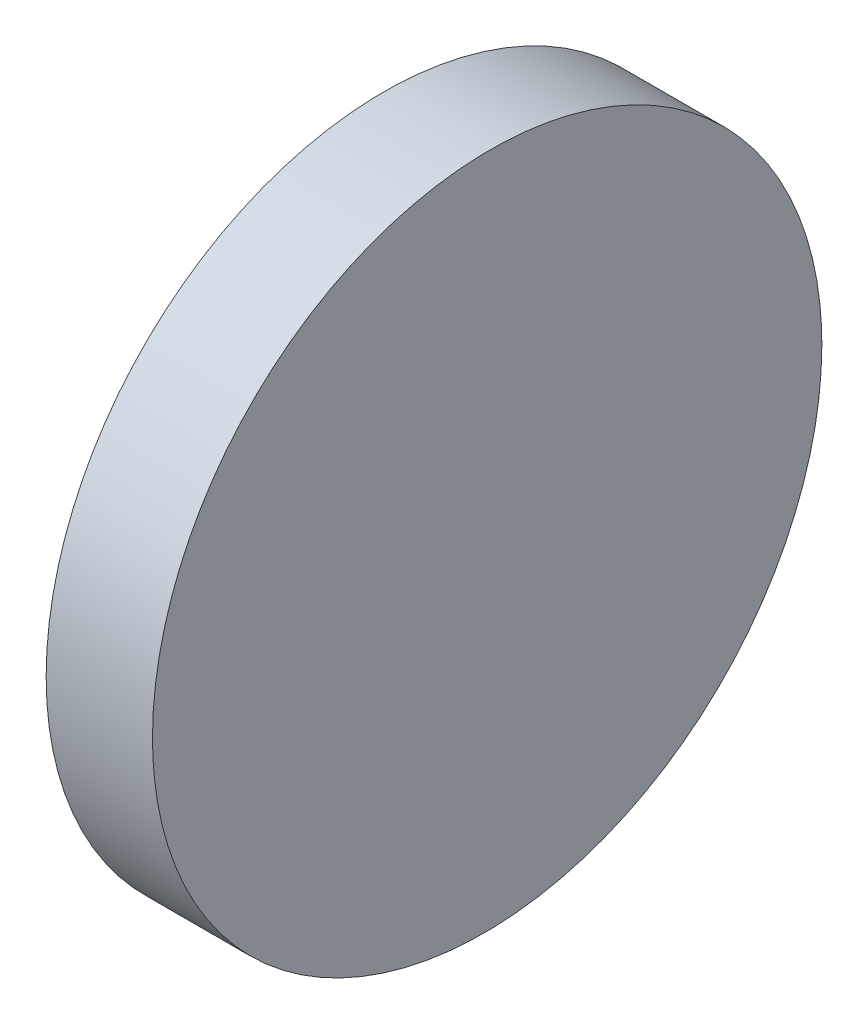
ISO-10303-21;
HEADER;
FILE_DESCRIPTION(('STEP AP214'),'2;1');
FILE_NAME('part.step','',(''),(''),'','','');
FILE_SCHEMA(('AUTOMOTIVE_DESIGN { 1 0 10303 214 1 1 1 1 }'));
ENDSEC;
DATA;
#1=APPLICATION_CONTEXT('core data for automotive mechanical design processes');
#2=APPLICATION_PROTOCOL_DEFINITION('international standard','automotive_design',2000,#1);
#3=PRODUCT_CONTEXT('',#1,'mechanical');
#4=PRODUCT('Part','Part','',(#3));
#5=PRODUCT_RELATED_PRODUCT_CATEGORY('part','',(#4));
#6=PRODUCT_DEFINITION_FORMATION('','',#4);
#7=PRODUCT_DEFINITION_CONTEXT('part definition',#1,'design');
#8=PRODUCT_DEFINITION('design','',#6,#7);
#9=PRODUCT_DEFINITION_SHAPE('','',#8);
#10=(LENGTH_UNIT() NAMED_UNIT(*) SI_UNIT(.MILLI.,.METRE.));
#11=(NAMED_UNIT(*) PLANE_ANGLE_UNIT() SI_UNIT($,.RADIAN.));
#12=(NAMED_UNIT(*) SI_UNIT($,.STERADIAN.) SOLID_ANGLE_UNIT());
#13=UNCERTAINTY_MEASURE_WITH_UNIT(LENGTH_MEASURE(1.E-05),#10,'distance_accuracy_value','');
#14=(GEOMETRIC_REPRESENTATION_CONTEXT(3) GLOBAL_UNCERTAINTY_ASSIGNED_CONTEXT((#13)) GLOBAL_UNIT_ASSIGNED_CONTEXT((#10,
#11,#12)) REPRESENTATION_CONTEXT('',''));
#15=CARTESIAN_POINT('',(0.,0.,0.));
#16=DIRECTION('',(0.,0.,1.));
#17=DIRECTION('',(1.,0.,0.));
#18=AXIS2_PLACEMENT_3D('',#15,#16,#17);
#19=CARTESIAN_POINT('',(0.,50.8,-25.4));
#20=DIRECTION('',(1.,0.,0.));
#21=DIRECTION('',(0.,0.,-1.));
#22=AXIS2_PLACEMENT_3D('',#19,#20,#21);
#23=PLANE('',#22);
#24=CARTESIAN_POINT('',(0.,25.4,0.));
#25=DIRECTION('',(-1.,0.,0.));
#26=DIRECTION('',(0.,0.,1.));
#27=AXIS2_PLACEMENT_3D('',#24,#25,#26);
#28=CIRCLE('',#27,25.4);
#29=CARTESIAN_POINT('',(0.,25.4,25.4));
#30=VERTEX_POINT('',#29);
#31=EDGE_CURVE('E75',#30,#30,#28,.T.);
#32=ORIENTED_EDGE('',*,*,#31,.T.);
#33=EDGE_LOOP('',(#32));
#34=FACE_BOUND('',#33,.T.);
#35=ADVANCED_FACE('F69',(#34),#23,.F.);
#36=CARTESIAN_POINT('',(8.00000000000001,50.8,25.4));
#37=DIRECTION('',(-0.999961923064172,0.,0.00872653549836699));
#38=DIRECTION('',(0.00872653549836699,0.,0.999961923064171));
#39=AXIS2_PLACEMENT_3D('',#36,#37,#38);
#40=PLANE('',#39);
#41=CARTESIAN_POINT('',(7.77833755811491,25.4,0.));
#42=DIRECTION('',(-0.999961923064172,0.,0.00872653549836699));
#43=DIRECTION('',(-0.00872653549836699,0.,-0.999961923064171));
#44=AXIS2_PLACEMENT_3D('',#41,#42,#43);
#45=ELLIPSE('',#44,25.4009671909977,25.4);
#46=CARTESIAN_POINT('',(7.55667511622981,25.4,-25.4));
#47=VERTEX_POINT('',#46);
#48=EDGE_CURVE('E11',#47,#47,#45,.T.);
#49=ORIENTED_EDGE('',*,*,#48,.F.);
#50=EDGE_LOOP('',(#49));
#51=FACE_BOUND('',#50,.T.);
#52=ADVANCED_FACE('F84',(#51),#40,.F.);
#53=CARTESIAN_POINT('',(12.5,25.4,0.));
#54=DIRECTION('',(-1.,0.,0.));
#55=DIRECTION('',(0.,0.,1.));
#56=AXIS2_PLACEMENT_3D('',#53,#54,#55);
#57=CYLINDRICAL_SURFACE('',#56,25.4);
#58=ORIENTED_EDGE('',*,*,#31,.F.);
#59=EDGE_LOOP('',(#58));
#60=FACE_BOUND('',#59,.T.);
#61=ORIENTED_EDGE('',*,*,#48,.T.);
#62=EDGE_LOOP('',(#61));
#63=FACE_BOUND('',#62,.T.);
#64=ADVANCED_FACE('F82',(#60,#63),#57,.T.);
#65=CLOSED_SHELL('',(#35,#52,#64));
#66=MANIFOLD_SOLID_BREP('B2',#65);
#67=ADVANCED_BREP_SHAPE_REPRESENTATION('',(#18,#66),#14);
#68=SHAPE_DEFINITION_REPRESENTATION(#9,#67);
ENDSEC;
END-ISO-10303-21;
